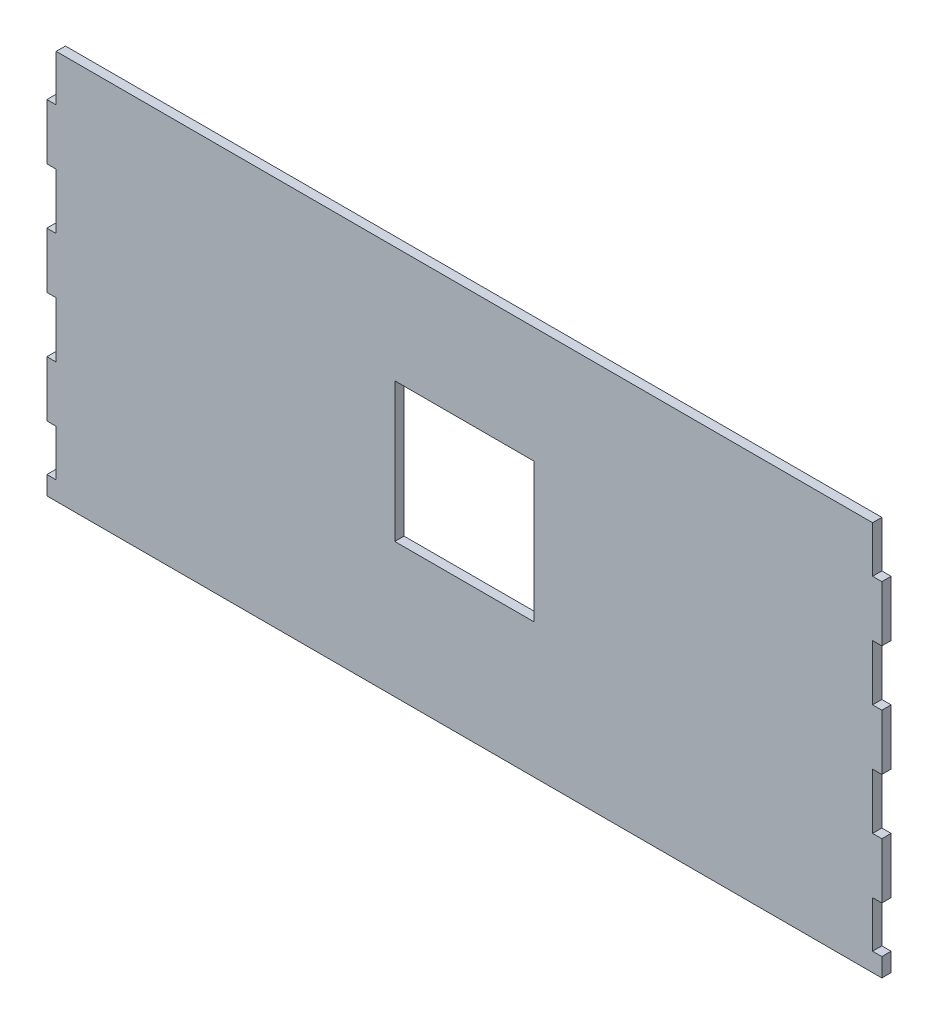
ISO-10303-21;
HEADER;
FILE_DESCRIPTION(('STEP AP214'),'2;1');
FILE_NAME('part.step','',(''),(''),'','','');
FILE_SCHEMA(('AUTOMOTIVE_DESIGN { 1 0 10303 214 1 1 1 1 }'));
ENDSEC;
DATA;
#1=APPLICATION_CONTEXT('core data for automotive mechanical design processes');
#2=APPLICATION_PROTOCOL_DEFINITION('international standard','automotive_design',2000,#1);
#3=PRODUCT_CONTEXT('',#1,'mechanical');
#4=PRODUCT('Part','Part','',(#3));
#5=PRODUCT_RELATED_PRODUCT_CATEGORY('part','',(#4));
#6=PRODUCT_DEFINITION_FORMATION('','',#4);
#7=PRODUCT_DEFINITION_CONTEXT('part definition',#1,'design');
#8=PRODUCT_DEFINITION('design','',#6,#7);
#9=PRODUCT_DEFINITION_SHAPE('','',#8);
#10=(LENGTH_UNIT() NAMED_UNIT(*) SI_UNIT(.MILLI.,.METRE.));
#11=(NAMED_UNIT(*) PLANE_ANGLE_UNIT() SI_UNIT($,.RADIAN.));
#12=(NAMED_UNIT(*) SI_UNIT($,.STERADIAN.) SOLID_ANGLE_UNIT());
#13=UNCERTAINTY_MEASURE_WITH_UNIT(LENGTH_MEASURE(1.E-05),#10,'distance_accuracy_value','');
#14=(GEOMETRIC_REPRESENTATION_CONTEXT(3) GLOBAL_UNCERTAINTY_ASSIGNED_CONTEXT((#13)) GLOBAL_UNIT_ASSIGNED_CONTEXT((#10,
#11,#12)) REPRESENTATION_CONTEXT('',''));
#15=CARTESIAN_POINT('',(0.,0.,0.));
#16=DIRECTION('',(0.,0.,1.));
#17=DIRECTION('',(1.,0.,0.));
#18=AXIS2_PLACEMENT_3D('',#15,#16,#17);
#19=CARTESIAN_POINT('',(225.,105.,5.));
#20=DIRECTION('',(-1.,0.,0.));
#21=DIRECTION('',(0.,-1.,0.));
#22=AXIS2_PLACEMENT_3D('',#19,#20,#21);
#23=PLANE('',#22);
#24=DIRECTION('',(0.,1.,0.));
#25=VECTOR('',#24,1.);
#26=CARTESIAN_POINT('',(225.,105.,0.));
#27=LINE('',#26,#25);
#28=CARTESIAN_POINT('',(225.,-105.,0.));
#29=VERTEX_POINT('',#28);
#30=CARTESIAN_POINT('',(225.,-95.,0.));
#31=VERTEX_POINT('',#30);
#32=EDGE_CURVE('E595',#29,#31,#27,.T.);
#33=ORIENTED_EDGE('',*,*,#32,.T.);
#34=DIRECTION('',(0.,0.,1.));
#35=VECTOR('',#34,1.);
#36=CARTESIAN_POINT('',(225.,-95.,5.));
#37=LINE('',#36,#35);
#38=CARTESIAN_POINT('',(225.,-95.,5.));
#39=VERTEX_POINT('',#38);
#40=EDGE_CURVE('E567',#31,#39,#37,.T.);
#41=ORIENTED_EDGE('',*,*,#40,.T.);
#42=DIRECTION('',(0.,1.,0.));
#43=VECTOR('',#42,1.);
#44=CARTESIAN_POINT('',(225.,105.,5.));
#45=LINE('',#44,#43);
#46=CARTESIAN_POINT('',(225.,-105.,5.));
#47=VERTEX_POINT('',#46);
#48=EDGE_CURVE('E576',#47,#39,#45,.T.);
#49=ORIENTED_EDGE('',*,*,#48,.F.);
#50=DIRECTION('',(0.,0.,-1.));
#51=VECTOR('',#50,1.);
#52=CARTESIAN_POINT('',(225.,-105.,5.));
#53=LINE('',#52,#51);
#54=EDGE_CURVE('E594',#47,#29,#53,.T.);
#55=ORIENTED_EDGE('',*,*,#54,.T.);
#56=EDGE_LOOP('',(#33,#41,#49,#55));
#57=FACE_BOUND('',#56,.T.);
#58=ADVANCED_FACE('F41',(#57),#23,.F.);
#59=CARTESIAN_POINT('',(225.,-70.,5.));
#60=VERTEX_POINT('',#59);
#61=CARTESIAN_POINT('',(225.,-40.,5.));
#62=VERTEX_POINT('',#61);
#63=EDGE_CURVE('E581',#60,#62,#45,.T.);
#64=ORIENTED_EDGE('',*,*,#63,.F.);
#65=DIRECTION('',(0.,0.,-1.));
#66=VECTOR('',#65,1.);
#67=CARTESIAN_POINT('',(225.,-70.,5.));
#68=LINE('',#67,#66);
#69=CARTESIAN_POINT('',(225.,-70.,0.));
#70=VERTEX_POINT('',#69);
#71=EDGE_CURVE('E563',#60,#70,#68,.T.);
#72=ORIENTED_EDGE('',*,*,#71,.T.);
#73=CARTESIAN_POINT('',(225.,-40.,0.));
#74=VERTEX_POINT('',#73);
#75=EDGE_CURVE('E600',#70,#74,#27,.T.);
#76=ORIENTED_EDGE('',*,*,#75,.T.);
#77=DIRECTION('',(0.,0.,1.));
#78=VECTOR('',#77,1.);
#79=CARTESIAN_POINT('',(225.,-40.,5.));
#80=LINE('',#79,#78);
#81=EDGE_CURVE('E559',#74,#62,#80,.T.);
#82=ORIENTED_EDGE('',*,*,#81,.T.);
#83=EDGE_LOOP('',(#64,#72,#76,#82));
#84=FACE_BOUND('',#83,.T.);
#85=ADVANCED_FACE('F651',(#84),#23,.F.);
#86=CARTESIAN_POINT('',(225.,-10.,5.));
#87=VERTEX_POINT('',#86);
#88=CARTESIAN_POINT('',(225.,20.,5.));
#89=VERTEX_POINT('',#88);
#90=EDGE_CURVE('E677',#87,#89,#45,.T.);
#91=ORIENTED_EDGE('',*,*,#90,.F.);
#92=DIRECTION('',(0.,0.,-1.));
#93=VECTOR('',#92,1.);
#94=CARTESIAN_POINT('',(225.,-10.,5.));
#95=LINE('',#94,#93);
#96=CARTESIAN_POINT('',(225.,-10.,0.));
#97=VERTEX_POINT('',#96);
#98=EDGE_CURVE('E555',#87,#97,#95,.T.);
#99=ORIENTED_EDGE('',*,*,#98,.T.);
#100=CARTESIAN_POINT('',(225.,20.,0.));
#101=VERTEX_POINT('',#100);
#102=EDGE_CURVE('E654',#97,#101,#27,.T.);
#103=ORIENTED_EDGE('',*,*,#102,.T.);
#104=DIRECTION('',(0.,0.,1.));
#105=VECTOR('',#104,1.);
#106=CARTESIAN_POINT('',(225.,20.,5.));
#107=LINE('',#106,#105);
#108=EDGE_CURVE('E551',#101,#89,#107,.T.);
#109=ORIENTED_EDGE('',*,*,#108,.T.);
#110=EDGE_LOOP('',(#91,#99,#103,#109));
#111=FACE_BOUND('',#110,.T.);
#112=ADVANCED_FACE('F775',(#111),#23,.F.);
#113=CARTESIAN_POINT('',(-225.,105.,5.));
#114=DIRECTION('',(1.,0.,0.));
#115=DIRECTION('',(0.,1.,0.));
#116=AXIS2_PLACEMENT_3D('',#113,#114,#115);
#117=PLANE('',#116);
#118=DIRECTION('',(0.,-1.,0.));
#119=VECTOR('',#118,1.);
#120=CARTESIAN_POINT('',(-225.,105.,5.));
#121=LINE('',#120,#119);
#122=CARTESIAN_POINT('',(-225.,20.,5.));
#123=VERTEX_POINT('',#122);
#124=CARTESIAN_POINT('',(-225.,-10.,5.));
#125=VERTEX_POINT('',#124);
#126=EDGE_CURVE('E744',#123,#125,#121,.T.);
#127=ORIENTED_EDGE('',*,*,#126,.F.);
#128=DIRECTION('',(0.,0.,-1.));
#129=VECTOR('',#128,1.);
#130=CARTESIAN_POINT('',(-225.,20.,5.));
#131=LINE('',#130,#129);
#132=CARTESIAN_POINT('',(-225.,20.,0.));
#133=VERTEX_POINT('',#132);
#134=EDGE_CURVE('E543',#123,#133,#131,.T.);
#135=ORIENTED_EDGE('',*,*,#134,.T.);
#136=DIRECTION('',(0.,-1.,0.));
#137=VECTOR('',#136,1.);
#138=CARTESIAN_POINT('',(-225.,105.,0.));
#139=LINE('',#138,#137);
#140=CARTESIAN_POINT('',(-225.,-10.,0.));
#141=VERTEX_POINT('',#140);
#142=EDGE_CURVE('E721',#133,#141,#139,.T.);
#143=ORIENTED_EDGE('',*,*,#142,.T.);
#144=DIRECTION('',(0.,0.,1.));
#145=VECTOR('',#144,1.);
#146=CARTESIAN_POINT('',(-225.,-10.,5.));
#147=LINE('',#146,#145);
#148=EDGE_CURVE('E531',#141,#125,#147,.T.);
#149=ORIENTED_EDGE('',*,*,#148,.T.);
#150=EDGE_LOOP('',(#127,#135,#143,#149));
#151=FACE_BOUND('',#150,.T.);
#152=ADVANCED_FACE('F758',(#151),#117,.F.);
#153=CARTESIAN_POINT('',(-225.,-40.,5.));
#154=VERTEX_POINT('',#153);
#155=CARTESIAN_POINT('',(-225.,-70.,5.));
#156=VERTEX_POINT('',#155);
#157=EDGE_CURVE('E589',#154,#156,#121,.T.);
#158=ORIENTED_EDGE('',*,*,#157,.F.);
#159=DIRECTION('',(0.,0.,-1.));
#160=VECTOR('',#159,1.);
#161=CARTESIAN_POINT('',(-225.,-40.,5.));
#162=LINE('',#161,#160);
#163=CARTESIAN_POINT('',(-225.,-40.,0.));
#164=VERTEX_POINT('',#163);
#165=EDGE_CURVE('E535',#154,#164,#162,.T.);
#166=ORIENTED_EDGE('',*,*,#165,.T.);
#167=CARTESIAN_POINT('',(-225.,-70.,0.));
#168=VERTEX_POINT('',#167);
#169=EDGE_CURVE('E607',#164,#168,#139,.T.);
#170=ORIENTED_EDGE('',*,*,#169,.T.);
#171=DIRECTION('',(0.,0.,1.));
#172=VECTOR('',#171,1.);
#173=CARTESIAN_POINT('',(-225.,-70.,5.));
#174=LINE('',#173,#172);
#175=EDGE_CURVE('E523',#168,#156,#174,.T.);
#176=ORIENTED_EDGE('',*,*,#175,.T.);
#177=EDGE_LOOP('',(#158,#166,#170,#176));
#178=FACE_BOUND('',#177,.T.);
#179=ADVANCED_FACE('F719',(#178),#117,.F.);
#180=CARTESIAN_POINT('',(-225.,-95.,5.));
#181=VERTEX_POINT('',#180);
#182=CARTESIAN_POINT('',(-225.,-105.,5.));
#183=VERTEX_POINT('',#182);
#184=EDGE_CURVE('E586',#181,#183,#121,.T.);
#185=ORIENTED_EDGE('',*,*,#184,.F.);
#186=DIRECTION('',(0.,0.,-1.));
#187=VECTOR('',#186,1.);
#188=CARTESIAN_POINT('',(-225.,-95.,5.));
#189=LINE('',#188,#187);
#190=CARTESIAN_POINT('',(-225.,-95.,0.));
#191=VERTEX_POINT('',#190);
#192=EDGE_CURVE('E527',#181,#191,#189,.T.);
#193=ORIENTED_EDGE('',*,*,#192,.T.);
#194=CARTESIAN_POINT('',(-225.,-105.,0.));
#195=VERTEX_POINT('',#194);
#196=EDGE_CURVE('E604',#191,#195,#139,.T.);
#197=ORIENTED_EDGE('',*,*,#196,.T.);
#198=DIRECTION('',(0.,0.,-1.));
#199=VECTOR('',#198,1.);
#200=CARTESIAN_POINT('',(-225.,-105.,5.));
#201=LINE('',#200,#199);
#202=EDGE_CURVE('E615',#183,#195,#201,.T.);
#203=ORIENTED_EDGE('',*,*,#202,.F.);
#204=EDGE_LOOP('',(#185,#193,#197,#203));
#205=FACE_BOUND('',#204,.T.);
#206=ADVANCED_FACE('F705',(#205),#117,.F.);
#207=CARTESIAN_POINT('',(225.,50.,5.));
#208=VERTEX_POINT('',#207);
#209=CARTESIAN_POINT('',(225.,80.,5.));
#210=VERTEX_POINT('',#209);
#211=EDGE_CURVE('E582',#208,#210,#45,.T.);
#212=ORIENTED_EDGE('',*,*,#211,.F.);
#213=DIRECTION('',(0.,0.,-1.));
#214=VECTOR('',#213,1.);
#215=CARTESIAN_POINT('',(225.,50.,5.));
#216=LINE('',#215,#214);
#217=CARTESIAN_POINT('',(225.,50.,0.));
#218=VERTEX_POINT('',#217);
#219=EDGE_CURVE('E547',#208,#218,#216,.T.);
#220=ORIENTED_EDGE('',*,*,#219,.T.);
#221=CARTESIAN_POINT('',(225.,80.,0.));
#222=VERTEX_POINT('',#221);
#223=EDGE_CURVE('E575',#218,#222,#27,.T.);
#224=ORIENTED_EDGE('',*,*,#223,.T.);
#225=DIRECTION('',(0.,0.,1.));
#226=VECTOR('',#225,1.);
#227=CARTESIAN_POINT('',(225.,80.,5.));
#228=LINE('',#227,#226);
#229=EDGE_CURVE('E516',#222,#210,#228,.T.);
#230=ORIENTED_EDGE('',*,*,#229,.T.);
#231=EDGE_LOOP('',(#212,#220,#224,#230));
#232=FACE_BOUND('',#231,.T.);
#233=ADVANCED_FACE('F43',(#232),#23,.F.);
#234=CARTESIAN_POINT('',(-225.,105.,5.));
#235=DIRECTION('',(0.,-1.,0.));
#236=DIRECTION('',(0.,0.,-1.));
#237=AXIS2_PLACEMENT_3D('',#234,#235,#236);
#238=PLANE('',#237);
#239=DIRECTION('',(-1.,0.,0.));
#240=VECTOR('',#239,1.);
#241=CARTESIAN_POINT('',(-225.,105.,0.));
#242=LINE('',#241,#240);
#243=CARTESIAN_POINT('',(220.,105.,0.));
#244=VERTEX_POINT('',#243);
#245=CARTESIAN_POINT('',(-220.,105.,0.));
#246=VERTEX_POINT('',#245);
#247=EDGE_CURVE('E599',#244,#246,#242,.T.);
#248=ORIENTED_EDGE('',*,*,#247,.T.);
#249=DIRECTION('',(0.,0.,-1.));
#250=VECTOR('',#249,1.);
#251=CARTESIAN_POINT('',(-220.,105.,5.));
#252=LINE('',#251,#250);
#253=CARTESIAN_POINT('',(-220.,105.,5.));
#254=VERTEX_POINT('',#253);
#255=EDGE_CURVE('E439',#254,#246,#252,.T.);
#256=ORIENTED_EDGE('',*,*,#255,.F.);
#257=DIRECTION('',(-1.,0.,0.));
#258=VECTOR('',#257,1.);
#259=CARTESIAN_POINT('',(-225.,105.,5.));
#260=LINE('',#259,#258);
#261=CARTESIAN_POINT('',(220.,105.,5.));
#262=VERTEX_POINT('',#261);
#263=EDGE_CURVE('E580',#262,#254,#260,.T.);
#264=ORIENTED_EDGE('',*,*,#263,.F.);
#265=DIRECTION('',(0.,0.,-1.));
#266=VECTOR('',#265,1.);
#267=CARTESIAN_POINT('',(220.,105.,5.));
#268=LINE('',#267,#266);
#269=EDGE_CURVE('E509',#262,#244,#268,.T.);
#270=ORIENTED_EDGE('',*,*,#269,.T.);
#271=EDGE_LOOP('',(#248,#256,#264,#270));
#272=FACE_BOUND('',#271,.T.);
#273=ADVANCED_FACE('F777',(#272),#238,.F.);
#274=CARTESIAN_POINT('',(-225.,80.,5.));
#275=VERTEX_POINT('',#274);
#276=CARTESIAN_POINT('',(-225.,50.,5.));
#277=VERTEX_POINT('',#276);
#278=EDGE_CURVE('E590',#275,#277,#121,.T.);
#279=ORIENTED_EDGE('',*,*,#278,.F.);
#280=DIRECTION('',(0.,0.,-1.));
#281=VECTOR('',#280,1.);
#282=CARTESIAN_POINT('',(-225.,80.,5.));
#283=LINE('',#282,#281);
#284=CARTESIAN_POINT('',(-225.,80.,0.));
#285=VERTEX_POINT('',#284);
#286=EDGE_CURVE('E571',#275,#285,#283,.T.);
#287=ORIENTED_EDGE('',*,*,#286,.T.);
#288=CARTESIAN_POINT('',(-225.,50.,0.));
#289=VERTEX_POINT('',#288);
#290=EDGE_CURVE('E608',#285,#289,#139,.T.);
#291=ORIENTED_EDGE('',*,*,#290,.T.);
#292=DIRECTION('',(0.,0.,1.));
#293=VECTOR('',#292,1.);
#294=CARTESIAN_POINT('',(-225.,50.,5.));
#295=LINE('',#294,#293);
#296=EDGE_CURVE('E539',#289,#277,#295,.T.);
#297=ORIENTED_EDGE('',*,*,#296,.T.);
#298=EDGE_LOOP('',(#279,#287,#291,#297));
#299=FACE_BOUND('',#298,.T.);
#300=ADVANCED_FACE('F730',(#299),#117,.F.);
#301=CARTESIAN_POINT('',(-225.,-105.,5.));
#302=DIRECTION('',(0.,1.,0.));
#303=DIRECTION('',(0.,0.,1.));
#304=AXIS2_PLACEMENT_3D('',#301,#302,#303);
#305=PLANE('',#304);
#306=DIRECTION('',(1.,0.,0.));
#307=VECTOR('',#306,1.);
#308=CARTESIAN_POINT('',(-225.,-105.,0.));
#309=LINE('',#308,#307);
#310=EDGE_CURVE('E609',#195,#29,#309,.T.);
#311=ORIENTED_EDGE('',*,*,#310,.T.);
#312=ORIENTED_EDGE('',*,*,#54,.F.);
#313=DIRECTION('',(1.,0.,0.));
#314=VECTOR('',#313,1.);
#315=CARTESIAN_POINT('',(-225.,-105.,5.));
#316=LINE('',#315,#314);
#317=EDGE_CURVE('E591',#183,#47,#316,.T.);
#318=ORIENTED_EDGE('',*,*,#317,.F.);
#319=ORIENTED_EDGE('',*,*,#202,.T.);
#320=EDGE_LOOP('',(#311,#312,#318,#319));
#321=FACE_BOUND('',#320,.T.);
#322=ADVANCED_FACE('F699',(#321),#305,.F.);
#323=CARTESIAN_POINT('',(0.,0.,5.));
#324=DIRECTION('',(0.,0.,1.));
#325=DIRECTION('',(1.,0.,0.));
#326=AXIS2_PLACEMENT_3D('',#323,#324,#325);
#327=PLANE('',#326);
#328=DIRECTION('',(0.,1.,0.));
#329=VECTOR('',#328,1.);
#330=CARTESIAN_POINT('',(-37.5,42.5,5.));
#331=LINE('',#330,#329);
#332=CARTESIAN_POINT('',(-37.5,-32.5,5.));
#333=VERTEX_POINT('',#332);
#334=CARTESIAN_POINT('',(-37.5,42.5,5.));
#335=VERTEX_POINT('',#334);
#336=EDGE_CURVE('E277',#333,#335,#331,.T.);
#337=ORIENTED_EDGE('',*,*,#336,.T.);
#338=DIRECTION('',(1.,0.,0.));
#339=VECTOR('',#338,1.);
#340=CARTESIAN_POINT('',(37.5,42.5,5.));
#341=LINE('',#340,#339);
#342=CARTESIAN_POINT('',(37.5,42.5,5.));
#343=VERTEX_POINT('',#342);
#344=EDGE_CURVE('E287',#335,#343,#341,.T.);
#345=ORIENTED_EDGE('',*,*,#344,.T.);
#346=DIRECTION('',(0.,-1.,0.));
#347=VECTOR('',#346,1.);
#348=CARTESIAN_POINT('',(37.5,42.5,5.));
#349=LINE('',#348,#347);
#350=CARTESIAN_POINT('',(37.5,-32.5,5.));
#351=VERTEX_POINT('',#350);
#352=EDGE_CURVE('E57',#343,#351,#349,.T.);
#353=ORIENTED_EDGE('',*,*,#352,.T.);
#354=DIRECTION('',(-1.,0.,0.));
#355=VECTOR('',#354,1.);
#356=CARTESIAN_POINT('',(37.5,-32.5,5.));
#357=LINE('',#356,#355);
#358=EDGE_CURVE('E284',#351,#333,#357,.T.);
#359=ORIENTED_EDGE('',*,*,#358,.T.);
#360=EDGE_LOOP('',(#337,#345,#353,#359));
#361=FACE_BOUND('',#360,.T.);
#362=DIRECTION('',(-1.,0.,0.));
#363=VECTOR('',#362,1.);
#364=CARTESIAN_POINT('',(-220.,80.,5.));
#365=LINE('',#364,#363);
#366=CARTESIAN_POINT('',(-220.,80.,5.));
#367=VERTEX_POINT('',#366);
#368=EDGE_CURVE('E434',#367,#275,#365,.T.);
#369=ORIENTED_EDGE('',*,*,#368,.T.);
#370=ORIENTED_EDGE('',*,*,#278,.T.);
#371=DIRECTION('',(1.,0.,0.));
#372=VECTOR('',#371,1.);
#373=CARTESIAN_POINT('',(-220.,50.,5.));
#374=LINE('',#373,#372);
#375=CARTESIAN_POINT('',(-220.,50.,5.));
#376=VERTEX_POINT('',#375);
#377=EDGE_CURVE('E324',#277,#376,#374,.T.);
#378=ORIENTED_EDGE('',*,*,#377,.T.);
#379=DIRECTION('',(0.,-1.,0.));
#380=VECTOR('',#379,1.);
#381=CARTESIAN_POINT('',(-220.,50.,5.));
#382=LINE('',#381,#380);
#383=CARTESIAN_POINT('',(-220.,20.,5.));
#384=VERTEX_POINT('',#383);
#385=EDGE_CURVE('E328',#376,#384,#382,.T.);
#386=ORIENTED_EDGE('',*,*,#385,.T.);
#387=DIRECTION('',(-1.,0.,0.));
#388=VECTOR('',#387,1.);
#389=CARTESIAN_POINT('',(-220.,20.,5.));
#390=LINE('',#389,#388);
#391=EDGE_CURVE('E333',#384,#123,#390,.T.);
#392=ORIENTED_EDGE('',*,*,#391,.T.);
#393=ORIENTED_EDGE('',*,*,#126,.T.);
#394=DIRECTION('',(1.,0.,0.));
#395=VECTOR('',#394,1.);
#396=CARTESIAN_POINT('',(-220.,-10.,5.));
#397=LINE('',#396,#395);
#398=CARTESIAN_POINT('',(-220.,-10.,5.));
#399=VERTEX_POINT('',#398);
#400=EDGE_CURVE('E352',#125,#399,#397,.T.);
#401=ORIENTED_EDGE('',*,*,#400,.T.);
#402=DIRECTION('',(0.,-1.,0.));
#403=VECTOR('',#402,1.);
#404=CARTESIAN_POINT('',(-220.,-10.,5.));
#405=LINE('',#404,#403);
#406=CARTESIAN_POINT('',(-220.,-40.,5.));
#407=VERTEX_POINT('',#406);
#408=EDGE_CURVE('E356',#399,#407,#405,.T.);
#409=ORIENTED_EDGE('',*,*,#408,.T.);
#410=DIRECTION('',(-1.,0.,0.));
#411=VECTOR('',#410,1.);
#412=CARTESIAN_POINT('',(-220.,-40.,5.));
#413=LINE('',#412,#411);
#414=EDGE_CURVE('E361',#407,#154,#413,.T.);
#415=ORIENTED_EDGE('',*,*,#414,.T.);
#416=ORIENTED_EDGE('',*,*,#157,.T.);
#417=DIRECTION('',(1.,0.,0.));
#418=VECTOR('',#417,1.);
#419=CARTESIAN_POINT('',(-220.,-70.,5.));
#420=LINE('',#419,#418);
#421=CARTESIAN_POINT('',(-220.,-70.,5.));
#422=VERTEX_POINT('',#421);
#423=EDGE_CURVE('E378',#156,#422,#420,.T.);
#424=ORIENTED_EDGE('',*,*,#423,.T.);
#425=DIRECTION('',(0.,-1.,0.));
#426=VECTOR('',#425,1.);
#427=CARTESIAN_POINT('',(-220.,-95.,5.));
#428=LINE('',#427,#426);
#429=CARTESIAN_POINT('',(-220.,-95.,5.));
#430=VERTEX_POINT('',#429);
#431=EDGE_CURVE('E382',#422,#430,#428,.T.);
#432=ORIENTED_EDGE('',*,*,#431,.T.);
#433=DIRECTION('',(-1.,0.,0.));
#434=VECTOR('',#433,1.);
#435=CARTESIAN_POINT('',(-220.,-95.,5.));
#436=LINE('',#435,#434);
#437=EDGE_CURVE('E387',#430,#181,#436,.T.);
#438=ORIENTED_EDGE('',*,*,#437,.T.);
#439=ORIENTED_EDGE('',*,*,#184,.T.);
#440=ORIENTED_EDGE('',*,*,#317,.T.);
#441=ORIENTED_EDGE('',*,*,#48,.T.);
#442=DIRECTION('',(-1.,0.,0.));
#443=VECTOR('',#442,1.);
#444=CARTESIAN_POINT('',(414.707934705798,-95.,5.));
#445=LINE('',#444,#443);
#446=CARTESIAN_POINT('',(220.,-95.,5.));
#447=VERTEX_POINT('',#446);
#448=EDGE_CURVE('E411',#39,#447,#445,.T.);
#449=ORIENTED_EDGE('',*,*,#448,.T.);
#450=DIRECTION('',(0.,1.,0.));
#451=VECTOR('',#450,1.);
#452=CARTESIAN_POINT('',(220.,-95.,5.));
#453=LINE('',#452,#451);
#454=CARTESIAN_POINT('',(220.,-70.,5.));
#455=VERTEX_POINT('',#454);
#456=EDGE_CURVE('E402',#447,#455,#453,.T.);
#457=ORIENTED_EDGE('',*,*,#456,.T.);
#458=DIRECTION('',(1.,0.,0.));
#459=VECTOR('',#458,1.);
#460=CARTESIAN_POINT('',(414.707934705798,-70.,5.));
#461=LINE('',#460,#459);
#462=EDGE_CURVE('E406',#455,#60,#461,.T.);
#463=ORIENTED_EDGE('',*,*,#462,.T.);
#464=ORIENTED_EDGE('',*,*,#63,.T.);
#465=DIRECTION('',(-1.,0.,0.));
#466=VECTOR('',#465,1.);
#467=CARTESIAN_POINT('',(412.205874683252,-40.,5.));
#468=LINE('',#467,#466);
#469=CARTESIAN_POINT('',(220.,-40.,5.));
#470=VERTEX_POINT('',#469);
#471=EDGE_CURVE('E486',#62,#470,#468,.T.);
#472=ORIENTED_EDGE('',*,*,#471,.T.);
#473=DIRECTION('',(0.,1.,0.));
#474=VECTOR('',#473,1.);
#475=CARTESIAN_POINT('',(220.,-10.,5.));
#476=LINE('',#475,#474);
#477=CARTESIAN_POINT('',(220.,-10.,5.));
#478=VERTEX_POINT('',#477);
#479=EDGE_CURVE('E477',#470,#478,#476,.T.);
#480=ORIENTED_EDGE('',*,*,#479,.T.);
#481=DIRECTION('',(1.,0.,0.));
#482=VECTOR('',#481,1.);
#483=CARTESIAN_POINT('',(412.205874683252,-9.99999999999998,5.));
#484=LINE('',#483,#482);
#485=EDGE_CURVE('E481',#478,#87,#484,.T.);
#486=ORIENTED_EDGE('',*,*,#485,.T.);
#487=ORIENTED_EDGE('',*,*,#90,.T.);
#488=DIRECTION('',(-1.,0.,0.));
#489=VECTOR('',#488,1.);
#490=CARTESIAN_POINT('',(363.228691137857,20.,5.));
#491=LINE('',#490,#489);
#492=CARTESIAN_POINT('',(220.,20.,5.));
#493=VERTEX_POINT('',#492);
#494=EDGE_CURVE('E458',#89,#493,#491,.T.);
#495=ORIENTED_EDGE('',*,*,#494,.T.);
#496=DIRECTION('',(0.,1.,0.));
#497=VECTOR('',#496,1.);
#498=CARTESIAN_POINT('',(220.,50.,5.));
#499=LINE('',#498,#497);
#500=CARTESIAN_POINT('',(220.,50.,5.));
#501=VERTEX_POINT('',#500);
#502=EDGE_CURVE('E449',#493,#501,#499,.T.);
#503=ORIENTED_EDGE('',*,*,#502,.T.);
#504=DIRECTION('',(1.,0.,0.));
#505=VECTOR('',#504,1.);
#506=CARTESIAN_POINT('',(363.228691137857,50.,5.));
#507=LINE('',#506,#505);
#508=EDGE_CURVE('E453',#501,#208,#507,.T.);
#509=ORIENTED_EDGE('',*,*,#508,.T.);
#510=ORIENTED_EDGE('',*,*,#211,.T.);
#511=DIRECTION('',(-1.,0.,0.));
#512=VECTOR('',#511,1.);
#513=CARTESIAN_POINT('',(285.821391224999,80.,5.));
#514=LINE('',#513,#512);
#515=CARTESIAN_POINT('',(220.,80.,5.));
#516=VERTEX_POINT('',#515);
#517=EDGE_CURVE('E505',#210,#516,#514,.T.);
#518=ORIENTED_EDGE('',*,*,#517,.T.);
#519=DIRECTION('',(0.,1.,0.));
#520=VECTOR('',#519,1.);
#521=CARTESIAN_POINT('',(220.,105.,5.));
#522=LINE('',#521,#520);
#523=EDGE_CURVE('E501',#516,#262,#522,.T.);
#524=ORIENTED_EDGE('',*,*,#523,.T.);
#525=ORIENTED_EDGE('',*,*,#263,.T.);
#526=DIRECTION('',(0.,-1.,0.));
#527=VECTOR('',#526,1.);
#528=CARTESIAN_POINT('',(-220.,105.,5.));
#529=LINE('',#528,#527);
#530=EDGE_CURVE('E430',#254,#367,#529,.T.);
#531=ORIENTED_EDGE('',*,*,#530,.T.);
#532=EDGE_LOOP('',(#369,#370,#378,#386,#392,#393,#401,#409,#415,#416,#424,#432,#438,#439,#440,
#441,#449,#457,#463,#464,#472,#480,#486,#487,#495,#503,#509,#510,#518,#524,#525,#531));
#533=FACE_BOUND('',#532,.T.);
#534=ADVANCED_FACE('F292',(#361,#533),#327,.T.);
#535=CARTESIAN_POINT('',(0.,0.,0.));
#536=DIRECTION('',(0.,0.,1.));
#537=DIRECTION('',(1.,0.,0.));
#538=AXIS2_PLACEMENT_3D('',#535,#536,#537);
#539=PLANE('',#538);
#540=DIRECTION('',(1.,0.,0.));
#541=VECTOR('',#540,1.);
#542=CARTESIAN_POINT('',(37.5,42.5,0.));
#543=LINE('',#542,#541);
#544=CARTESIAN_POINT('',(-37.5,42.5,0.));
#545=VERTEX_POINT('',#544);
#546=CARTESIAN_POINT('',(37.5,42.5,0.));
#547=VERTEX_POINT('',#546);
#548=EDGE_CURVE('E309',#545,#547,#543,.T.);
#549=ORIENTED_EDGE('',*,*,#548,.F.);
#550=DIRECTION('',(0.,1.,0.));
#551=VECTOR('',#550,1.);
#552=CARTESIAN_POINT('',(-37.5,42.5,0.));
#553=LINE('',#552,#551);
#554=CARTESIAN_POINT('',(-37.5,-32.5,0.));
#555=VERTEX_POINT('',#554);
#556=EDGE_CURVE('E65',#555,#545,#553,.T.);
#557=ORIENTED_EDGE('',*,*,#556,.F.);
#558=DIRECTION('',(-1.,0.,0.));
#559=VECTOR('',#558,1.);
#560=CARTESIAN_POINT('',(37.5,-32.5,0.));
#561=LINE('',#560,#559);
#562=CARTESIAN_POINT('',(37.5,-32.5,0.));
#563=VERTEX_POINT('',#562);
#564=EDGE_CURVE('E296',#563,#555,#561,.T.);
#565=ORIENTED_EDGE('',*,*,#564,.F.);
#566=DIRECTION('',(0.,-1.,0.));
#567=VECTOR('',#566,1.);
#568=CARTESIAN_POINT('',(37.5,42.5,0.));
#569=LINE('',#568,#567);
#570=EDGE_CURVE('E300',#547,#563,#569,.T.);
#571=ORIENTED_EDGE('',*,*,#570,.F.);
#572=EDGE_LOOP('',(#549,#557,#565,#571));
#573=FACE_BOUND('',#572,.T.);
#574=ORIENTED_EDGE('',*,*,#290,.F.);
#575=DIRECTION('',(-1.,0.,0.));
#576=VECTOR('',#575,1.);
#577=CARTESIAN_POINT('',(-220.,80.,0.));
#578=LINE('',#577,#576);
#579=CARTESIAN_POINT('',(-220.,80.,0.));
#580=VERTEX_POINT('',#579);
#581=EDGE_CURVE('E435',#580,#285,#578,.T.);
#582=ORIENTED_EDGE('',*,*,#581,.F.);
#583=DIRECTION('',(0.,-1.,0.));
#584=VECTOR('',#583,1.);
#585=CARTESIAN_POINT('',(-220.,105.,0.));
#586=LINE('',#585,#584);
#587=EDGE_CURVE('E348',#246,#580,#586,.T.);
#588=ORIENTED_EDGE('',*,*,#587,.F.);
#589=ORIENTED_EDGE('',*,*,#247,.F.);
#590=DIRECTION('',(0.,1.,0.));
#591=VECTOR('',#590,1.);
#592=CARTESIAN_POINT('',(220.,105.,0.));
#593=LINE('',#592,#591);
#594=CARTESIAN_POINT('',(220.,80.,0.));
#595=VERTEX_POINT('',#594);
#596=EDGE_CURVE('E473',#595,#244,#593,.T.);
#597=ORIENTED_EDGE('',*,*,#596,.F.);
#598=DIRECTION('',(1.,0.,0.));
#599=VECTOR('',#598,1.);
#600=CARTESIAN_POINT('',(0.,79.9999999999999,0.));
#601=LINE('',#600,#599);
#602=EDGE_CURVE('E619',#595,#222,#601,.T.);
#603=ORIENTED_EDGE('',*,*,#602,.T.);
#604=ORIENTED_EDGE('',*,*,#223,.F.);
#605=DIRECTION('',(1.,0.,0.));
#606=VECTOR('',#605,1.);
#607=CARTESIAN_POINT('',(363.228691137857,50.,0.));
#608=LINE('',#607,#606);
#609=CARTESIAN_POINT('',(220.,50.,0.));
#610=VERTEX_POINT('',#609);
#611=EDGE_CURVE('E454',#610,#218,#608,.T.);
#612=ORIENTED_EDGE('',*,*,#611,.F.);
#613=DIRECTION('',(0.,1.,0.));
#614=VECTOR('',#613,1.);
#615=CARTESIAN_POINT('',(220.,50.,0.));
#616=LINE('',#615,#614);
#617=CARTESIAN_POINT('',(220.,20.,0.));
#618=VERTEX_POINT('',#617);
#619=EDGE_CURVE('E463',#618,#610,#616,.T.);
#620=ORIENTED_EDGE('',*,*,#619,.F.);
#621=DIRECTION('',(1.,0.,0.));
#622=VECTOR('',#621,1.);
#623=CARTESIAN_POINT('',(0.,19.9999999999999,0.));
#624=LINE('',#623,#622);
#625=EDGE_CURVE('E635',#618,#101,#624,.T.);
#626=ORIENTED_EDGE('',*,*,#625,.T.);
#627=ORIENTED_EDGE('',*,*,#102,.F.);
#628=DIRECTION('',(1.,0.,0.));
#629=VECTOR('',#628,1.);
#630=CARTESIAN_POINT('',(412.205874683252,-9.99999999999998,0.));
#631=LINE('',#630,#629);
#632=CARTESIAN_POINT('',(220.,-10.,0.));
#633=VERTEX_POINT('',#632);
#634=EDGE_CURVE('E482',#633,#97,#631,.T.);
#635=ORIENTED_EDGE('',*,*,#634,.F.);
#636=DIRECTION('',(0.,1.,0.));
#637=VECTOR('',#636,1.);
#638=CARTESIAN_POINT('',(220.,-10.,0.));
#639=LINE('',#638,#637);
#640=CARTESIAN_POINT('',(220.,-40.,0.));
#641=VERTEX_POINT('',#640);
#642=EDGE_CURVE('E426',#641,#633,#639,.T.);
#643=ORIENTED_EDGE('',*,*,#642,.F.);
#644=DIRECTION('',(1.,0.,0.));
#645=VECTOR('',#644,1.);
#646=CARTESIAN_POINT('',(0.,-40.,0.));
#647=LINE('',#646,#645);
#648=EDGE_CURVE('E50',#641,#74,#647,.T.);
#649=ORIENTED_EDGE('',*,*,#648,.T.);
#650=ORIENTED_EDGE('',*,*,#75,.F.);
#651=DIRECTION('',(1.,0.,0.));
#652=VECTOR('',#651,1.);
#653=CARTESIAN_POINT('',(414.707934705798,-70.,0.));
#654=LINE('',#653,#652);
#655=CARTESIAN_POINT('',(220.,-70.,0.));
#656=VERTEX_POINT('',#655);
#657=EDGE_CURVE('E407',#656,#70,#654,.T.);
#658=ORIENTED_EDGE('',*,*,#657,.F.);
#659=DIRECTION('',(0.,1.,0.));
#660=VECTOR('',#659,1.);
#661=CARTESIAN_POINT('',(220.,-95.,0.));
#662=LINE('',#661,#660);
#663=CARTESIAN_POINT('',(220.,-95.,0.));
#664=VERTEX_POINT('',#663);
#665=EDGE_CURVE('E416',#664,#656,#662,.T.);
#666=ORIENTED_EDGE('',*,*,#665,.F.);
#667=DIRECTION('',(1.,0.,0.));
#668=VECTOR('',#667,1.);
#669=CARTESIAN_POINT('',(0.,-95.,0.));
#670=LINE('',#669,#668);
#671=EDGE_CURVE('E11',#664,#31,#670,.T.);
#672=ORIENTED_EDGE('',*,*,#671,.T.);
#673=ORIENTED_EDGE('',*,*,#32,.F.);
#674=ORIENTED_EDGE('',*,*,#310,.F.);
#675=ORIENTED_EDGE('',*,*,#196,.F.);
#676=DIRECTION('',(-1.,0.,0.));
#677=VECTOR('',#676,1.);
#678=CARTESIAN_POINT('',(-220.,-95.,0.));
#679=LINE('',#678,#677);
#680=CARTESIAN_POINT('',(-220.,-95.,0.));
#681=VERTEX_POINT('',#680);
#682=EDGE_CURVE('E383',#681,#191,#679,.T.);
#683=ORIENTED_EDGE('',*,*,#682,.F.);
#684=DIRECTION('',(0.,-1.,0.));
#685=VECTOR('',#684,1.);
#686=CARTESIAN_POINT('',(-220.,-95.,0.));
#687=LINE('',#686,#685);
#688=CARTESIAN_POINT('',(-220.,-70.,0.));
#689=VERTEX_POINT('',#688);
#690=EDGE_CURVE('E318',#689,#681,#687,.T.);
#691=ORIENTED_EDGE('',*,*,#690,.F.);
#692=DIRECTION('',(-1.,0.,0.));
#693=VECTOR('',#692,1.);
#694=CARTESIAN_POINT('',(0.,-70.,0.));
#695=LINE('',#694,#693);
#696=EDGE_CURVE('E623',#689,#168,#695,.T.);
#697=ORIENTED_EDGE('',*,*,#696,.T.);
#698=ORIENTED_EDGE('',*,*,#169,.F.);
#699=DIRECTION('',(-1.,0.,0.));
#700=VECTOR('',#699,1.);
#701=CARTESIAN_POINT('',(-220.,-40.,0.));
#702=LINE('',#701,#700);
#703=CARTESIAN_POINT('',(-220.,-40.,0.));
#704=VERTEX_POINT('',#703);
#705=EDGE_CURVE('E357',#704,#164,#702,.T.);
#706=ORIENTED_EDGE('',*,*,#705,.F.);
#707=DIRECTION('',(0.,-1.,0.));
#708=VECTOR('',#707,1.);
#709=CARTESIAN_POINT('',(-220.,-10.,0.));
#710=LINE('',#709,#708);
#711=CARTESIAN_POINT('',(-220.,-10.,0.));
#712=VERTEX_POINT('',#711);
#713=EDGE_CURVE('E366',#712,#704,#710,.T.);
#714=ORIENTED_EDGE('',*,*,#713,.F.);
#715=DIRECTION('',(-1.,0.,0.));
#716=VECTOR('',#715,1.);
#717=CARTESIAN_POINT('',(0.,-10.,0.));
#718=LINE('',#717,#716);
#719=EDGE_CURVE('E627',#712,#141,#718,.T.);
#720=ORIENTED_EDGE('',*,*,#719,.T.);
#721=ORIENTED_EDGE('',*,*,#142,.F.);
#722=DIRECTION('',(-1.,0.,0.));
#723=VECTOR('',#722,1.);
#724=CARTESIAN_POINT('',(-220.,20.,0.));
#725=LINE('',#724,#723);
#726=CARTESIAN_POINT('',(-220.,20.,0.));
#727=VERTEX_POINT('',#726);
#728=EDGE_CURVE('E329',#727,#133,#725,.T.);
#729=ORIENTED_EDGE('',*,*,#728,.F.);
#730=DIRECTION('',(0.,-1.,0.));
#731=VECTOR('',#730,1.);
#732=CARTESIAN_POINT('',(-220.,50.,0.));
#733=LINE('',#732,#731);
#734=CARTESIAN_POINT('',(-220.,50.,0.));
#735=VERTEX_POINT('',#734);
#736=EDGE_CURVE('E338',#735,#727,#733,.T.);
#737=ORIENTED_EDGE('',*,*,#736,.F.);
#738=DIRECTION('',(-1.,0.,0.));
#739=VECTOR('',#738,1.);
#740=CARTESIAN_POINT('',(0.,50.,0.));
#741=LINE('',#740,#739);
#742=EDGE_CURVE('E631',#735,#289,#741,.T.);
#743=ORIENTED_EDGE('',*,*,#742,.T.);
#744=EDGE_LOOP('',(#574,#582,#588,#589,#597,#603,#604,#612,#620,#626,#627,#635,#643,#649,#650,
#658,#666,#672,#673,#674,#675,#683,#691,#697,#698,#706,#714,#720,#721,#729,#737,#743));
#745=FACE_BOUND('',#744,.T.);
#746=ADVANCED_FACE('F645',(#573,#745),#539,.F.);
#747=CARTESIAN_POINT('',(285.821391224999,80.,5.));
#748=DIRECTION('',(0.,-1.,0.));
#749=DIRECTION('',(1.,0.,0.));
#750=AXIS2_PLACEMENT_3D('',#747,#748,#749);
#751=PLANE('',#750);
#752=ORIENTED_EDGE('',*,*,#602,.F.);
#753=DIRECTION('',(0.,0.,-1.));
#754=VECTOR('',#753,1.);
#755=CARTESIAN_POINT('',(220.,80.,5.));
#756=LINE('',#755,#754);
#757=EDGE_CURVE('E512',#516,#595,#756,.T.);
#758=ORIENTED_EDGE('',*,*,#757,.F.);
#759=ORIENTED_EDGE('',*,*,#517,.F.);
#760=ORIENTED_EDGE('',*,*,#229,.F.);
#761=EDGE_LOOP('',(#752,#758,#759,#760));
#762=FACE_BOUND('',#761,.T.);
#763=ADVANCED_FACE('F670',(#762),#751,.F.);
#764=CARTESIAN_POINT('',(220.,105.,5.));
#765=DIRECTION('',(-1.,0.,0.));
#766=DIRECTION('',(0.,0.,1.));
#767=AXIS2_PLACEMENT_3D('',#764,#765,#766);
#768=PLANE('',#767);
#769=ORIENTED_EDGE('',*,*,#596,.T.);
#770=ORIENTED_EDGE('',*,*,#269,.F.);
#771=ORIENTED_EDGE('',*,*,#523,.F.);
#772=ORIENTED_EDGE('',*,*,#757,.T.);
#773=EDGE_LOOP('',(#769,#770,#771,#772));
#774=FACE_BOUND('',#773,.T.);
#775=ADVANCED_FACE('F673',(#774),#768,.F.);
#776=CARTESIAN_POINT('',(-220.,-95.,5.));
#777=DIRECTION('',(0.,-1.,0.));
#778=DIRECTION('',(0.,0.,-1.));
#779=AXIS2_PLACEMENT_3D('',#776,#777,#778);
#780=PLANE('',#779);
#781=ORIENTED_EDGE('',*,*,#437,.F.);
#782=DIRECTION('',(0.,0.,-1.));
#783=VECTOR('',#782,1.);
#784=CARTESIAN_POINT('',(-220.,-95.,5.));
#785=LINE('',#784,#783);
#786=EDGE_CURVE('E370',#430,#681,#785,.T.);
#787=ORIENTED_EDGE('',*,*,#786,.T.);
#788=ORIENTED_EDGE('',*,*,#682,.T.);
#789=ORIENTED_EDGE('',*,*,#192,.F.);
#790=EDGE_LOOP('',(#781,#787,#788,#789));
#791=FACE_BOUND('',#790,.T.);
#792=ADVANCED_FACE('F708',(#791),#780,.F.);
#793=CARTESIAN_POINT('',(-220.,-70.,5.));
#794=DIRECTION('',(0.,1.,0.));
#795=DIRECTION('',(0.,0.,1.));
#796=AXIS2_PLACEMENT_3D('',#793,#794,#795);
#797=PLANE('',#796);
#798=ORIENTED_EDGE('',*,*,#696,.F.);
#799=DIRECTION('',(0.,0.,-1.));
#800=VECTOR('',#799,1.);
#801=CARTESIAN_POINT('',(-220.,-70.,5.));
#802=LINE('',#801,#800);
#803=EDGE_CURVE('E391',#422,#689,#802,.T.);
#804=ORIENTED_EDGE('',*,*,#803,.F.);
#805=ORIENTED_EDGE('',*,*,#423,.F.);
#806=ORIENTED_EDGE('',*,*,#175,.F.);
#807=EDGE_LOOP('',(#798,#804,#805,#806));
#808=FACE_BOUND('',#807,.T.);
#809=ADVANCED_FACE('F859',(#808),#797,.F.);
#810=CARTESIAN_POINT('',(-220.,-95.,5.));
#811=DIRECTION('',(1.,0.,0.));
#812=DIRECTION('',(0.,0.,-1.));
#813=AXIS2_PLACEMENT_3D('',#810,#811,#812);
#814=PLANE('',#813);
#815=ORIENTED_EDGE('',*,*,#690,.T.);
#816=ORIENTED_EDGE('',*,*,#786,.F.);
#817=ORIENTED_EDGE('',*,*,#431,.F.);
#818=ORIENTED_EDGE('',*,*,#803,.T.);
#819=EDGE_LOOP('',(#815,#816,#817,#818));
#820=FACE_BOUND('',#819,.T.);
#821=ADVANCED_FACE('F712',(#820),#814,.F.);
#822=CARTESIAN_POINT('',(-220.,-40.,5.));
#823=DIRECTION('',(0.,-1.,0.));
#824=DIRECTION('',(0.,0.,-1.));
#825=AXIS2_PLACEMENT_3D('',#822,#823,#824);
#826=PLANE('',#825);
#827=ORIENTED_EDGE('',*,*,#414,.F.);
#828=DIRECTION('',(0.,0.,-1.));
#829=VECTOR('',#828,1.);
#830=CARTESIAN_POINT('',(-220.,-40.,5.));
#831=LINE('',#830,#829);
#832=EDGE_CURVE('E342',#407,#704,#831,.T.);
#833=ORIENTED_EDGE('',*,*,#832,.T.);
#834=ORIENTED_EDGE('',*,*,#705,.T.);
#835=ORIENTED_EDGE('',*,*,#165,.F.);
#836=EDGE_LOOP('',(#827,#833,#834,#835));
#837=FACE_BOUND('',#836,.T.);
#838=ADVANCED_FACE('F752',(#837),#826,.F.);
#839=CARTESIAN_POINT('',(-220.,-10.,5.));
#840=DIRECTION('',(0.,1.,0.));
#841=DIRECTION('',(0.,0.,1.));
#842=AXIS2_PLACEMENT_3D('',#839,#840,#841);
#843=PLANE('',#842);
#844=ORIENTED_EDGE('',*,*,#719,.F.);
#845=DIRECTION('',(0.,0.,-1.));
#846=VECTOR('',#845,1.);
#847=CARTESIAN_POINT('',(-220.,-10.,5.));
#848=LINE('',#847,#846);
#849=EDGE_CURVE('E365',#399,#712,#848,.T.);
#850=ORIENTED_EDGE('',*,*,#849,.F.);
#851=ORIENTED_EDGE('',*,*,#400,.F.);
#852=ORIENTED_EDGE('',*,*,#148,.F.);
#853=EDGE_LOOP('',(#844,#850,#851,#852));
#854=FACE_BOUND('',#853,.T.);
#855=ADVANCED_FACE('F757',(#854),#843,.F.);
#856=CARTESIAN_POINT('',(-220.,-10.,5.));
#857=DIRECTION('',(1.,0.,0.));
#858=DIRECTION('',(0.,0.,-1.));
#859=AXIS2_PLACEMENT_3D('',#856,#857,#858);
#860=PLANE('',#859);
#861=ORIENTED_EDGE('',*,*,#713,.T.);
#862=ORIENTED_EDGE('',*,*,#832,.F.);
#863=ORIENTED_EDGE('',*,*,#408,.F.);
#864=ORIENTED_EDGE('',*,*,#849,.T.);
#865=EDGE_LOOP('',(#861,#862,#863,#864));
#866=FACE_BOUND('',#865,.T.);
#867=ADVANCED_FACE('F755',(#866),#860,.F.);
#868=CARTESIAN_POINT('',(-220.,20.,5.));
#869=DIRECTION('',(0.,-1.,0.));
#870=DIRECTION('',(0.,0.,-1.));
#871=AXIS2_PLACEMENT_3D('',#868,#869,#870);
#872=PLANE('',#871);
#873=ORIENTED_EDGE('',*,*,#391,.F.);
#874=DIRECTION('',(0.,0.,-1.));
#875=VECTOR('',#874,1.);
#876=CARTESIAN_POINT('',(-220.,20.,5.));
#877=LINE('',#876,#875);
#878=EDGE_CURVE('E345',#384,#727,#877,.T.);
#879=ORIENTED_EDGE('',*,*,#878,.T.);
#880=ORIENTED_EDGE('',*,*,#728,.T.);
#881=ORIENTED_EDGE('',*,*,#134,.F.);
#882=EDGE_LOOP('',(#873,#879,#880,#881));
#883=FACE_BOUND('',#882,.T.);
#884=ADVANCED_FACE('F760',(#883),#872,.F.);
#885=CARTESIAN_POINT('',(-220.,50.,5.));
#886=DIRECTION('',(0.,1.,0.));
#887=DIRECTION('',(0.,0.,1.));
#888=AXIS2_PLACEMENT_3D('',#885,#886,#887);
#889=PLANE('',#888);
#890=ORIENTED_EDGE('',*,*,#742,.F.);
#891=DIRECTION('',(0.,0.,-1.));
#892=VECTOR('',#891,1.);
#893=CARTESIAN_POINT('',(-220.,50.,5.));
#894=LINE('',#893,#892);
#895=EDGE_CURVE('E337',#376,#735,#894,.T.);
#896=ORIENTED_EDGE('',*,*,#895,.F.);
#897=ORIENTED_EDGE('',*,*,#377,.F.);
#898=ORIENTED_EDGE('',*,*,#296,.F.);
#899=EDGE_LOOP('',(#890,#896,#897,#898));
#900=FACE_BOUND('',#899,.T.);
#901=ADVANCED_FACE('F737',(#900),#889,.F.);
#902=CARTESIAN_POINT('',(-220.,50.,5.));
#903=DIRECTION('',(1.,0.,0.));
#904=DIRECTION('',(0.,0.,-1.));
#905=AXIS2_PLACEMENT_3D('',#902,#903,#904);
#906=PLANE('',#905);
#907=ORIENTED_EDGE('',*,*,#736,.T.);
#908=ORIENTED_EDGE('',*,*,#878,.F.);
#909=ORIENTED_EDGE('',*,*,#385,.F.);
#910=ORIENTED_EDGE('',*,*,#895,.T.);
#911=EDGE_LOOP('',(#907,#908,#909,#910));
#912=FACE_BOUND('',#911,.T.);
#913=ADVANCED_FACE('F740',(#912),#906,.F.);
#914=CARTESIAN_POINT('',(363.228691137857,20.,5.));
#915=DIRECTION('',(0.,-1.,0.));
#916=DIRECTION('',(1.,0.,0.));
#917=AXIS2_PLACEMENT_3D('',#914,#915,#916);
#918=PLANE('',#917);
#919=ORIENTED_EDGE('',*,*,#625,.F.);
#920=DIRECTION('',(0.,0.,-1.));
#921=VECTOR('',#920,1.);
#922=CARTESIAN_POINT('',(220.,20.,5.));
#923=LINE('',#922,#921);
#924=EDGE_CURVE('E469',#493,#618,#923,.T.);
#925=ORIENTED_EDGE('',*,*,#924,.F.);
#926=ORIENTED_EDGE('',*,*,#494,.F.);
#927=ORIENTED_EDGE('',*,*,#108,.F.);
#928=EDGE_LOOP('',(#919,#925,#926,#927));
#929=FACE_BOUND('',#928,.T.);
#930=ADVANCED_FACE('F789',(#929),#918,.F.);
#931=CARTESIAN_POINT('',(363.228691137857,50.,5.));
#932=DIRECTION('',(0.,1.,0.));
#933=DIRECTION('',(-1.,0.,0.));
#934=AXIS2_PLACEMENT_3D('',#931,#932,#933);
#935=PLANE('',#934);
#936=ORIENTED_EDGE('',*,*,#508,.F.);
#937=DIRECTION('',(0.,0.,-1.));
#938=VECTOR('',#937,1.);
#939=CARTESIAN_POINT('',(220.,50.,5.));
#940=LINE('',#939,#938);
#941=EDGE_CURVE('E462',#501,#610,#940,.T.);
#942=ORIENTED_EDGE('',*,*,#941,.T.);
#943=ORIENTED_EDGE('',*,*,#611,.T.);
#944=ORIENTED_EDGE('',*,*,#219,.F.);
#945=EDGE_LOOP('',(#936,#942,#943,#944));
#946=FACE_BOUND('',#945,.T.);
#947=ADVANCED_FACE('F794',(#946),#935,.F.);
#948=CARTESIAN_POINT('',(220.,50.,5.));
#949=DIRECTION('',(-1.,0.,0.));
#950=DIRECTION('',(0.,0.,1.));
#951=AXIS2_PLACEMENT_3D('',#948,#949,#950);
#952=PLANE('',#951);
#953=ORIENTED_EDGE('',*,*,#619,.T.);
#954=ORIENTED_EDGE('',*,*,#941,.F.);
#955=ORIENTED_EDGE('',*,*,#502,.F.);
#956=ORIENTED_EDGE('',*,*,#924,.T.);
#957=EDGE_LOOP('',(#953,#954,#955,#956));
#958=FACE_BOUND('',#957,.T.);
#959=ADVANCED_FACE('F791',(#958),#952,.F.);
#960=CARTESIAN_POINT('',(412.205874683252,-40.,5.));
#961=DIRECTION('',(0.,-1.,0.));
#962=DIRECTION('',(1.,0.,0.));
#963=AXIS2_PLACEMENT_3D('',#960,#961,#962);
#964=PLANE('',#963);
#965=ORIENTED_EDGE('',*,*,#648,.F.);
#966=DIRECTION('',(0.,0.,-1.));
#967=VECTOR('',#966,1.);
#968=CARTESIAN_POINT('',(220.,-40.,5.));
#969=LINE('',#968,#967);
#970=EDGE_CURVE('E466',#470,#641,#969,.T.);
#971=ORIENTED_EDGE('',*,*,#970,.F.);
#972=ORIENTED_EDGE('',*,*,#471,.F.);
#973=ORIENTED_EDGE('',*,*,#81,.F.);
#974=EDGE_LOOP('',(#965,#971,#972,#973));
#975=FACE_BOUND('',#974,.T.);
#976=ADVANCED_FACE('F801',(#975),#964,.F.);
#977=CARTESIAN_POINT('',(412.205874683252,-9.99999999999998,5.));
#978=DIRECTION('',(0.,1.,0.));
#979=DIRECTION('',(-1.,0.,0.));
#980=AXIS2_PLACEMENT_3D('',#977,#978,#979);
#981=PLANE('',#980);
#982=ORIENTED_EDGE('',*,*,#485,.F.);
#983=DIRECTION('',(0.,0.,-1.));
#984=VECTOR('',#983,1.);
#985=CARTESIAN_POINT('',(220.,-10.,5.));
#986=LINE('',#985,#984);
#987=EDGE_CURVE('E490',#478,#633,#986,.T.);
#988=ORIENTED_EDGE('',*,*,#987,.T.);
#989=ORIENTED_EDGE('',*,*,#634,.T.);
#990=ORIENTED_EDGE('',*,*,#98,.F.);
#991=EDGE_LOOP('',(#982,#988,#989,#990));
#992=FACE_BOUND('',#991,.T.);
#993=ADVANCED_FACE('F808',(#992),#981,.F.);
#994=CARTESIAN_POINT('',(220.,-10.,5.));
#995=DIRECTION('',(-1.,0.,0.));
#996=DIRECTION('',(0.,0.,1.));
#997=AXIS2_PLACEMENT_3D('',#994,#995,#996);
#998=PLANE('',#997);
#999=ORIENTED_EDGE('',*,*,#642,.T.);
#1000=ORIENTED_EDGE('',*,*,#987,.F.);
#1001=ORIENTED_EDGE('',*,*,#479,.F.);
#1002=ORIENTED_EDGE('',*,*,#970,.T.);
#1003=EDGE_LOOP('',(#999,#1000,#1001,#1002));
#1004=FACE_BOUND('',#1003,.T.);
#1005=ADVANCED_FACE('F811',(#1004),#998,.F.);
#1006=CARTESIAN_POINT('',(414.707934705798,-95.,5.));
#1007=DIRECTION('',(0.,-1.,0.));
#1008=DIRECTION('',(1.,0.,0.));
#1009=AXIS2_PLACEMENT_3D('',#1006,#1007,#1008);
#1010=PLANE('',#1009);
#1011=ORIENTED_EDGE('',*,*,#671,.F.);
#1012=DIRECTION('',(0.,0.,-1.));
#1013=VECTOR('',#1012,1.);
#1014=CARTESIAN_POINT('',(220.,-95.,5.));
#1015=LINE('',#1014,#1013);
#1016=EDGE_CURVE('E422',#447,#664,#1015,.T.);
#1017=ORIENTED_EDGE('',*,*,#1016,.F.);
#1018=ORIENTED_EDGE('',*,*,#448,.F.);
#1019=ORIENTED_EDGE('',*,*,#40,.F.);
#1020=EDGE_LOOP('',(#1011,#1017,#1018,#1019));
#1021=FACE_BOUND('',#1020,.T.);
#1022=ADVANCED_FACE('F691',(#1021),#1010,.F.);
#1023=CARTESIAN_POINT('',(414.707934705798,-70.,5.));
#1024=DIRECTION('',(0.,1.,0.));
#1025=DIRECTION('',(-1.,0.,0.));
#1026=AXIS2_PLACEMENT_3D('',#1023,#1024,#1025);
#1027=PLANE('',#1026);
#1028=ORIENTED_EDGE('',*,*,#462,.F.);
#1029=DIRECTION('',(0.,0.,-1.));
#1030=VECTOR('',#1029,1.);
#1031=CARTESIAN_POINT('',(220.,-70.,5.));
#1032=LINE('',#1031,#1030);
#1033=EDGE_CURVE('E415',#455,#656,#1032,.T.);
#1034=ORIENTED_EDGE('',*,*,#1033,.T.);
#1035=ORIENTED_EDGE('',*,*,#657,.T.);
#1036=ORIENTED_EDGE('',*,*,#71,.F.);
#1037=EDGE_LOOP('',(#1028,#1034,#1035,#1036));
#1038=FACE_BOUND('',#1037,.T.);
#1039=ADVANCED_FACE('F685',(#1038),#1027,.F.);
#1040=CARTESIAN_POINT('',(220.,-95.,5.));
#1041=DIRECTION('',(-1.,0.,0.));
#1042=DIRECTION('',(0.,0.,1.));
#1043=AXIS2_PLACEMENT_3D('',#1040,#1041,#1042);
#1044=PLANE('',#1043);
#1045=ORIENTED_EDGE('',*,*,#665,.T.);
#1046=ORIENTED_EDGE('',*,*,#1033,.F.);
#1047=ORIENTED_EDGE('',*,*,#456,.F.);
#1048=ORIENTED_EDGE('',*,*,#1016,.T.);
#1049=EDGE_LOOP('',(#1045,#1046,#1047,#1048));
#1050=FACE_BOUND('',#1049,.T.);
#1051=ADVANCED_FACE('F689',(#1050),#1044,.F.);
#1052=CARTESIAN_POINT('',(-220.,80.,5.));
#1053=DIRECTION('',(0.,-1.,0.));
#1054=DIRECTION('',(0.,0.,-1.));
#1055=AXIS2_PLACEMENT_3D('',#1052,#1053,#1054);
#1056=PLANE('',#1055);
#1057=ORIENTED_EDGE('',*,*,#368,.F.);
#1058=DIRECTION('',(0.,0.,-1.));
#1059=VECTOR('',#1058,1.);
#1060=CARTESIAN_POINT('',(-220.,80.,5.));
#1061=LINE('',#1060,#1059);
#1062=EDGE_CURVE('E419',#367,#580,#1061,.T.);
#1063=ORIENTED_EDGE('',*,*,#1062,.T.);
#1064=ORIENTED_EDGE('',*,*,#581,.T.);
#1065=ORIENTED_EDGE('',*,*,#286,.F.);
#1066=EDGE_LOOP('',(#1057,#1063,#1064,#1065));
#1067=FACE_BOUND('',#1066,.T.);
#1068=ADVANCED_FACE('F964',(#1067),#1056,.F.);
#1069=CARTESIAN_POINT('',(-220.,105.,5.));
#1070=DIRECTION('',(1.,0.,0.));
#1071=DIRECTION('',(0.,0.,-1.));
#1072=AXIS2_PLACEMENT_3D('',#1069,#1070,#1071);
#1073=PLANE('',#1072);
#1074=ORIENTED_EDGE('',*,*,#587,.T.);
#1075=ORIENTED_EDGE('',*,*,#1062,.F.);
#1076=ORIENTED_EDGE('',*,*,#530,.F.);
#1077=ORIENTED_EDGE('',*,*,#255,.T.);
#1078=EDGE_LOOP('',(#1074,#1075,#1076,#1077));
#1079=FACE_BOUND('',#1078,.T.);
#1080=ADVANCED_FACE('F972',(#1079),#1073,.F.);
#1081=CARTESIAN_POINT('',(-37.5,42.5,5.));
#1082=DIRECTION('',(-1.,0.,0.));
#1083=DIRECTION('',(0.,-1.,0.));
#1084=AXIS2_PLACEMENT_3D('',#1081,#1082,#1083);
#1085=PLANE('',#1084);
#1086=ORIENTED_EDGE('',*,*,#556,.T.);
#1087=DIRECTION('',(0.,0.,-1.));
#1088=VECTOR('',#1087,1.);
#1089=CARTESIAN_POINT('',(-37.5,42.5,5.));
#1090=LINE('',#1089,#1088);
#1091=EDGE_CURVE('E273',#335,#545,#1090,.T.);
#1092=ORIENTED_EDGE('',*,*,#1091,.F.);
#1093=ORIENTED_EDGE('',*,*,#336,.F.);
#1094=DIRECTION('',(0.,0.,-1.));
#1095=VECTOR('',#1094,1.);
#1096=CARTESIAN_POINT('',(-37.5,-32.5,5.));
#1097=LINE('',#1096,#1095);
#1098=EDGE_CURVE('E315',#333,#555,#1097,.T.);
#1099=ORIENTED_EDGE('',*,*,#1098,.T.);
#1100=EDGE_LOOP('',(#1086,#1092,#1093,#1099));
#1101=FACE_BOUND('',#1100,.T.);
#1102=ADVANCED_FACE('F275',(#1101),#1085,.F.);
#1103=CARTESIAN_POINT('',(37.5,-32.5,5.));
#1104=DIRECTION('',(0.,-1.,0.));
#1105=DIRECTION('',(0.,0.,-1.));
#1106=AXIS2_PLACEMENT_3D('',#1103,#1104,#1105);
#1107=PLANE('',#1106);
#1108=ORIENTED_EDGE('',*,*,#564,.T.);
#1109=ORIENTED_EDGE('',*,*,#1098,.F.);
#1110=ORIENTED_EDGE('',*,*,#358,.F.);
#1111=DIRECTION('',(0.,0.,-1.));
#1112=VECTOR('',#1111,1.);
#1113=CARTESIAN_POINT('',(37.5,-32.5,5.));
#1114=LINE('',#1113,#1112);
#1115=EDGE_CURVE('E319',#351,#563,#1114,.T.);
#1116=ORIENTED_EDGE('',*,*,#1115,.T.);
#1117=EDGE_LOOP('',(#1108,#1109,#1110,#1116));
#1118=FACE_BOUND('',#1117,.T.);
#1119=ADVANCED_FACE('F989',(#1118),#1107,.F.);
#1120=CARTESIAN_POINT('',(37.5,42.5,5.));
#1121=DIRECTION('',(1.,0.,0.));
#1122=DIRECTION('',(0.,1.,0.));
#1123=AXIS2_PLACEMENT_3D('',#1120,#1121,#1122);
#1124=PLANE('',#1123);
#1125=ORIENTED_EDGE('',*,*,#570,.T.);
#1126=ORIENTED_EDGE('',*,*,#1115,.F.);
#1127=ORIENTED_EDGE('',*,*,#352,.F.);
#1128=DIRECTION('',(0.,0.,-1.));
#1129=VECTOR('',#1128,1.);
#1130=CARTESIAN_POINT('',(37.5,42.5,5.));
#1131=LINE('',#1130,#1129);
#1132=EDGE_CURVE('E283',#343,#547,#1131,.T.);
#1133=ORIENTED_EDGE('',*,*,#1132,.T.);
#1134=EDGE_LOOP('',(#1125,#1126,#1127,#1133));
#1135=FACE_BOUND('',#1134,.T.);
#1136=ADVANCED_FACE('F994',(#1135),#1124,.F.);
#1137=CARTESIAN_POINT('',(37.5,42.5,5.));
#1138=DIRECTION('',(0.,1.,0.));
#1139=DIRECTION('',(0.,0.,1.));
#1140=AXIS2_PLACEMENT_3D('',#1137,#1138,#1139);
#1141=PLANE('',#1140);
#1142=ORIENTED_EDGE('',*,*,#548,.T.);
#1143=ORIENTED_EDGE('',*,*,#1132,.F.);
#1144=ORIENTED_EDGE('',*,*,#344,.F.);
#1145=ORIENTED_EDGE('',*,*,#1091,.T.);
#1146=EDGE_LOOP('',(#1142,#1143,#1144,#1145));
#1147=FACE_BOUND('',#1146,.T.);
#1148=ADVANCED_FACE('F288',(#1147),#1141,.F.);
#1149=CLOSED_SHELL('',(#58,#85,#112,#152,#179,#206,#233,#273,#300,#322,#534,#746,#763,#775,#792,
#809,#821,#838,#855,#867,#884,#901,#913,#930,#947,#959,#976,#993,#1005,#1022,#1039,#1051,#1068,
#1080,#1102,#1119,#1136,#1148));
#1150=MANIFOLD_SOLID_BREP('B2',#1149);
#1151=ADVANCED_BREP_SHAPE_REPRESENTATION('',(#18,#1150),#14);
#1152=SHAPE_DEFINITION_REPRESENTATION(#9,#1151);
ENDSEC;
END-ISO-10303-21;
